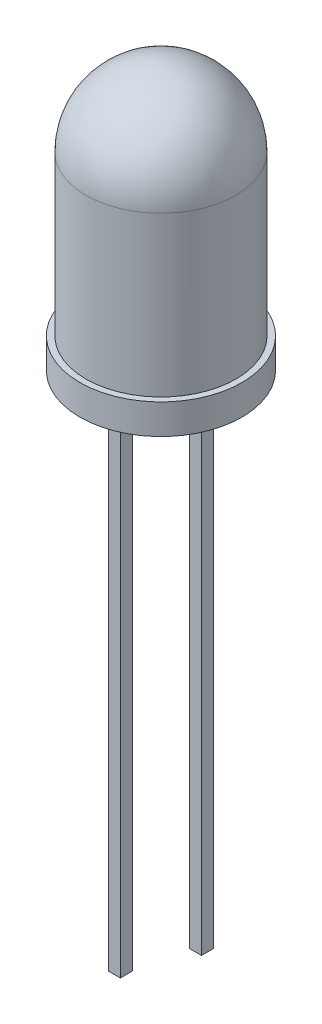
ISO-10303-21;
HEADER;
FILE_DESCRIPTION(('STEP AP214'),'2;1');
FILE_NAME('part.step','',(''),(''),'','','');
FILE_SCHEMA(('AUTOMOTIVE_DESIGN { 1 0 10303 214 1 1 1 1 }'));
ENDSEC;
DATA;
#1=APPLICATION_CONTEXT('core data for automotive mechanical design processes');
#2=APPLICATION_PROTOCOL_DEFINITION('international standard','automotive_design',2000,#1);
#3=PRODUCT_CONTEXT('',#1,'mechanical');
#4=PRODUCT('Part','Part','',(#3));
#5=PRODUCT_RELATED_PRODUCT_CATEGORY('part','',(#4));
#6=PRODUCT_DEFINITION_FORMATION('','',#4);
#7=PRODUCT_DEFINITION_CONTEXT('part definition',#1,'design');
#8=PRODUCT_DEFINITION('design','',#6,#7);
#9=PRODUCT_DEFINITION_SHAPE('','',#8);
#10=(LENGTH_UNIT() NAMED_UNIT(*) SI_UNIT(.MILLI.,.METRE.));
#11=(NAMED_UNIT(*) PLANE_ANGLE_UNIT() SI_UNIT($,.RADIAN.));
#12=(NAMED_UNIT(*) SI_UNIT($,.STERADIAN.) SOLID_ANGLE_UNIT());
#13=UNCERTAINTY_MEASURE_WITH_UNIT(LENGTH_MEASURE(1.E-05),#10,'distance_accuracy_value','');
#14=(GEOMETRIC_REPRESENTATION_CONTEXT(3) GLOBAL_UNCERTAINTY_ASSIGNED_CONTEXT((#13)) GLOBAL_UNIT_ASSIGNED_CONTEXT((#10,
#11,#12)) REPRESENTATION_CONTEXT('',''));
#15=CARTESIAN_POINT('',(0.,0.,0.));
#16=DIRECTION('',(0.,0.,1.));
#17=DIRECTION('',(1.,0.,0.));
#18=AXIS2_PLACEMENT_3D('',#15,#16,#17);
#19=CARTESIAN_POINT('',(0.,0.,0.));
#20=DIRECTION('',(0.,1.,0.));
#21=DIRECTION('',(0.,0.,1.));
#22=AXIS2_PLACEMENT_3D('',#19,#20,#21);
#23=PLANE('',#22);
#24=DIRECTION('',(-1.,0.,0.));
#25=VECTOR('',#24,1.);
#26=CARTESIAN_POINT('',(1.15,0.,-0.2));
#27=LINE('',#26,#25);
#28=CARTESIAN_POINT('',(1.55,0.,-0.2));
#29=VERTEX_POINT('',#28);
#30=CARTESIAN_POINT('',(1.15,0.,-0.2));
#31=VERTEX_POINT('',#30);
#32=EDGE_CURVE('E154',#29,#31,#27,.T.);
#33=ORIENTED_EDGE('',*,*,#32,.T.);
#34=DIRECTION('',(0.,0.,1.));
#35=VECTOR('',#34,1.);
#36=CARTESIAN_POINT('',(1.15,0.,-0.2));
#37=LINE('',#36,#35);
#38=CARTESIAN_POINT('',(1.15,0.,0.2));
#39=VERTEX_POINT('',#38);
#40=EDGE_CURVE('E158',#31,#39,#37,.T.);
#41=ORIENTED_EDGE('',*,*,#40,.T.);
#42=DIRECTION('',(-1.,0.,0.));
#43=VECTOR('',#42,1.);
#44=CARTESIAN_POINT('',(1.15,0.,0.2));
#45=LINE('',#44,#43);
#46=CARTESIAN_POINT('',(1.55,0.,0.2));
#47=VERTEX_POINT('',#46);
#48=EDGE_CURVE('E144',#47,#39,#45,.T.);
#49=ORIENTED_EDGE('',*,*,#48,.F.);
#50=DIRECTION('',(0.,0.,1.));
#51=VECTOR('',#50,1.);
#52=CARTESIAN_POINT('',(1.55,0.,-0.2));
#53=LINE('',#52,#51);
#54=EDGE_CURVE('E162',#29,#47,#53,.T.);
#55=ORIENTED_EDGE('',*,*,#54,.F.);
#56=EDGE_LOOP('',(#33,#41,#49,#55));
#57=FACE_BOUND('',#56,.T.);
#58=CARTESIAN_POINT('',(0.,0.,0.));
#59=DIRECTION('',(0.,1.,0.));
#60=DIRECTION('',(0.,0.,1.));
#61=AXIS2_PLACEMENT_3D('',#58,#59,#60);
#62=CIRCLE('',#61,2.7);
#63=CARTESIAN_POINT('',(0.,0.,2.7));
#64=VERTEX_POINT('',#63);
#65=EDGE_CURVE('E11',#64,#64,#62,.T.);
#66=ORIENTED_EDGE('',*,*,#65,.F.);
#67=EDGE_LOOP('',(#66));
#68=FACE_BOUND('',#67,.T.);
#69=DIRECTION('',(-1.,0.,0.));
#70=VECTOR('',#69,1.);
#71=CARTESIAN_POINT('',(-1.55,0.,-0.2));
#72=LINE('',#71,#70);
#73=CARTESIAN_POINT('',(-1.15,0.,-0.2));
#74=VERTEX_POINT('',#73);
#75=CARTESIAN_POINT('',(-1.55,0.,-0.2));
#76=VERTEX_POINT('',#75);
#77=EDGE_CURVE('E114',#74,#76,#72,.T.);
#78=ORIENTED_EDGE('',*,*,#77,.T.);
#79=DIRECTION('',(0.,0.,1.));
#80=VECTOR('',#79,1.);
#81=CARTESIAN_POINT('',(-1.55,0.,-0.2));
#82=LINE('',#81,#80);
#83=CARTESIAN_POINT('',(-1.55,0.,0.2));
#84=VERTEX_POINT('',#83);
#85=EDGE_CURVE('E133',#76,#84,#82,.T.);
#86=ORIENTED_EDGE('',*,*,#85,.T.);
#87=DIRECTION('',(-1.,0.,0.));
#88=VECTOR('',#87,1.);
#89=CARTESIAN_POINT('',(-1.55,0.,0.2));
#90=LINE('',#89,#88);
#91=CARTESIAN_POINT('',(-1.15,0.,0.2));
#92=VERTEX_POINT('',#91);
#93=EDGE_CURVE('E121',#92,#84,#90,.T.);
#94=ORIENTED_EDGE('',*,*,#93,.F.);
#95=DIRECTION('',(0.,0.,1.));
#96=VECTOR('',#95,1.);
#97=CARTESIAN_POINT('',(-1.15,0.,-0.2));
#98=LINE('',#97,#96);
#99=EDGE_CURVE('E136',#74,#92,#98,.T.);
#100=ORIENTED_EDGE('',*,*,#99,.F.);
#101=EDGE_LOOP('',(#78,#86,#94,#100));
#102=FACE_BOUND('',#101,.T.);
#103=ADVANCED_FACE('F36',(#57,#68,#102),#23,.F.);
#104=CARTESIAN_POINT('',(0.,8.8,0.));
#105=DIRECTION('',(0.,1.,0.));
#106=DIRECTION('',(0.,0.,1.));
#107=AXIS2_PLACEMENT_3D('',#104,#105,#106);
#108=CYLINDRICAL_SURFACE('',#107,2.7);
#109=CARTESIAN_POINT('',(0.,1.,0.));
#110=DIRECTION('',(0.,1.,0.));
#111=DIRECTION('',(0.,0.,1.));
#112=AXIS2_PLACEMENT_3D('',#109,#110,#111);
#113=CIRCLE('',#112,2.7);
#114=CARTESIAN_POINT('',(0.,1.,2.7));
#115=VERTEX_POINT('',#114);
#116=EDGE_CURVE('E43',#115,#115,#113,.T.);
#117=ORIENTED_EDGE('',*,*,#116,.F.);
#118=EDGE_LOOP('',(#117));
#119=FACE_BOUND('',#118,.T.);
#120=ORIENTED_EDGE('',*,*,#65,.T.);
#121=EDGE_LOOP('',(#120));
#122=FACE_BOUND('',#121,.T.);
#123=ADVANCED_FACE('F176',(#119,#122),#108,.T.);
#124=CARTESIAN_POINT('',(2.7,1.,0.));
#125=DIRECTION('',(0.,-1.,0.));
#126=DIRECTION('',(0.,0.,-1.));
#127=AXIS2_PLACEMENT_3D('',#124,#125,#126);
#128=PLANE('',#127);
#129=CARTESIAN_POINT('',(0.,1.,0.));
#130=DIRECTION('',(0.,1.,0.));
#131=DIRECTION('',(0.,0.,1.));
#132=AXIS2_PLACEMENT_3D('',#129,#130,#131);
#133=CIRCLE('',#132,2.5);
#134=CARTESIAN_POINT('',(0.,1.,2.5));
#135=VERTEX_POINT('',#134);
#136=EDGE_CURVE('E169',#135,#135,#133,.T.);
#137=ORIENTED_EDGE('',*,*,#136,.F.);
#138=EDGE_LOOP('',(#137));
#139=FACE_BOUND('',#138,.T.);
#140=ORIENTED_EDGE('',*,*,#116,.T.);
#141=EDGE_LOOP('',(#140));
#142=FACE_BOUND('',#141,.T.);
#143=ADVANCED_FACE('F174',(#139,#142),#128,.F.);
#144=CARTESIAN_POINT('',(0.,8.8,0.));
#145=DIRECTION('',(0.,1.,0.));
#146=DIRECTION('',(0.,0.,1.));
#147=AXIS2_PLACEMENT_3D('',#144,#145,#146);
#148=CYLINDRICAL_SURFACE('',#147,2.5);
#149=CARTESIAN_POINT('',(0.,6.3,0.));
#150=DIRECTION('',(0.,1.,0.));
#151=DIRECTION('',(0.,0.,1.));
#152=AXIS2_PLACEMENT_3D('',#149,#150,#151);
#153=CIRCLE('',#152,2.5);
#154=CARTESIAN_POINT('',(0.,6.3,2.5));
#155=VERTEX_POINT('',#154);
#156=EDGE_CURVE('E161',#155,#155,#153,.T.);
#157=ORIENTED_EDGE('',*,*,#156,.F.);
#158=EDGE_LOOP('',(#157));
#159=FACE_BOUND('',#158,.T.);
#160=ORIENTED_EDGE('',*,*,#136,.T.);
#161=EDGE_LOOP('',(#160));
#162=FACE_BOUND('',#161,.T.);
#163=ADVANCED_FACE('F224',(#159,#162),#148,.T.);
#164=CARTESIAN_POINT('',(0.,6.3,0.));
#165=DIRECTION('',(0.,1.,0.));
#166=DIRECTION('',(1.,0.,0.));
#167=AXIS2_PLACEMENT_3D('',#164,#165,#166);
#168=SPHERICAL_SURFACE('',#167,2.5);
#169=ORIENTED_EDGE('',*,*,#156,.T.);
#170=EDGE_LOOP('',(#169));
#171=FACE_BOUND('',#170,.T.);
#172=ADVANCED_FACE('F220',(#171),#168,.T.);
#173=CARTESIAN_POINT('',(1.15,0.,-0.2));
#174=DIRECTION('',(-1.,0.,0.));
#175=DIRECTION('',(0.,-1.,0.));
#176=AXIS2_PLACEMENT_3D('',#173,#174,#175);
#177=PLANE('',#176);
#178=DIRECTION('',(0.,0.,1.));
#179=VECTOR('',#178,1.);
#180=CARTESIAN_POINT('',(1.15,-16.,-0.2));
#181=LINE('',#180,#179);
#182=CARTESIAN_POINT('',(1.15,-16.,-0.2));
#183=VERTEX_POINT('',#182);
#184=CARTESIAN_POINT('',(1.15,-16.,0.2));
#185=VERTEX_POINT('',#184);
#186=EDGE_CURVE('E157',#183,#185,#181,.T.);
#187=ORIENTED_EDGE('',*,*,#186,.T.);
#188=DIRECTION('',(0.,-1.,0.));
#189=VECTOR('',#188,1.);
#190=CARTESIAN_POINT('',(1.15,0.,0.2));
#191=LINE('',#190,#189);
#192=EDGE_CURVE('E135',#39,#185,#191,.T.);
#193=ORIENTED_EDGE('',*,*,#192,.F.);
#194=ORIENTED_EDGE('',*,*,#40,.F.);
#195=DIRECTION('',(0.,-1.,0.));
#196=VECTOR('',#195,1.);
#197=CARTESIAN_POINT('',(1.15,0.,-0.2));
#198=LINE('',#197,#196);
#199=EDGE_CURVE('E146',#31,#183,#198,.T.);
#200=ORIENTED_EDGE('',*,*,#199,.T.);
#201=EDGE_LOOP('',(#187,#193,#194,#200));
#202=FACE_BOUND('',#201,.T.);
#203=ADVANCED_FACE('F213',(#202),#177,.T.);
#204=CARTESIAN_POINT('',(1.55,0.,-0.2));
#205=DIRECTION('',(1.,0.,0.));
#206=DIRECTION('',(0.,1.,0.));
#207=AXIS2_PLACEMENT_3D('',#204,#205,#206);
#208=PLANE('',#207);
#209=ORIENTED_EDGE('',*,*,#54,.T.);
#210=DIRECTION('',(0.,1.,0.));
#211=VECTOR('',#210,1.);
#212=CARTESIAN_POINT('',(1.55,0.,0.2));
#213=LINE('',#212,#211);
#214=CARTESIAN_POINT('',(1.55,-16.,0.2));
#215=VERTEX_POINT('',#214);
#216=EDGE_CURVE('E58',#215,#47,#213,.T.);
#217=ORIENTED_EDGE('',*,*,#216,.F.);
#218=DIRECTION('',(0.,0.,1.));
#219=VECTOR('',#218,1.);
#220=CARTESIAN_POINT('',(1.55,-16.,-0.2));
#221=LINE('',#220,#219);
#222=CARTESIAN_POINT('',(1.55,-16.,-0.2));
#223=VERTEX_POINT('',#222);
#224=EDGE_CURVE('E164',#223,#215,#221,.T.);
#225=ORIENTED_EDGE('',*,*,#224,.F.);
#226=DIRECTION('',(0.,1.,0.));
#227=VECTOR('',#226,1.);
#228=CARTESIAN_POINT('',(1.55,0.,-0.2));
#229=LINE('',#228,#227);
#230=EDGE_CURVE('E152',#223,#29,#229,.T.);
#231=ORIENTED_EDGE('',*,*,#230,.T.);
#232=EDGE_LOOP('',(#209,#217,#225,#231));
#233=FACE_BOUND('',#232,.T.);
#234=ADVANCED_FACE('F210',(#233),#208,.T.);
#235=CARTESIAN_POINT('',(1.15,-16.,-0.2));
#236=DIRECTION('',(0.,-1.,0.));
#237=DIRECTION('',(0.,0.,-1.));
#238=AXIS2_PLACEMENT_3D('',#235,#236,#237);
#239=PLANE('',#238);
#240=ORIENTED_EDGE('',*,*,#224,.T.);
#241=DIRECTION('',(1.,0.,0.));
#242=VECTOR('',#241,1.);
#243=CARTESIAN_POINT('',(1.15,-16.,0.2));
#244=LINE('',#243,#242);
#245=EDGE_CURVE('E141',#185,#215,#244,.T.);
#246=ORIENTED_EDGE('',*,*,#245,.F.);
#247=ORIENTED_EDGE('',*,*,#186,.F.);
#248=DIRECTION('',(1.,0.,0.));
#249=VECTOR('',#248,1.);
#250=CARTESIAN_POINT('',(1.15,-16.,-0.2));
#251=LINE('',#250,#249);
#252=EDGE_CURVE('E149',#183,#223,#251,.T.);
#253=ORIENTED_EDGE('',*,*,#252,.T.);
#254=EDGE_LOOP('',(#240,#246,#247,#253));
#255=FACE_BOUND('',#254,.T.);
#256=ADVANCED_FACE('F208',(#255),#239,.T.);
#257=CARTESIAN_POINT('',(0.,0.,-0.2));
#258=DIRECTION('',(0.,0.,1.));
#259=DIRECTION('',(1.,0.,0.));
#260=AXIS2_PLACEMENT_3D('',#257,#258,#259);
#261=PLANE('',#260);
#262=ORIENTED_EDGE('',*,*,#199,.F.);
#263=ORIENTED_EDGE('',*,*,#32,.F.);
#264=ORIENTED_EDGE('',*,*,#230,.F.);
#265=ORIENTED_EDGE('',*,*,#252,.F.);
#266=EDGE_LOOP('',(#262,#263,#264,#265));
#267=FACE_BOUND('',#266,.T.);
#268=ADVANCED_FACE('F205',(#267),#261,.F.);
#269=CARTESIAN_POINT('',(0.,0.,0.2));
#270=DIRECTION('',(0.,0.,1.));
#271=DIRECTION('',(1.,0.,0.));
#272=AXIS2_PLACEMENT_3D('',#269,#270,#271);
#273=PLANE('',#272);
#274=ORIENTED_EDGE('',*,*,#192,.T.);
#275=ORIENTED_EDGE('',*,*,#245,.T.);
#276=ORIENTED_EDGE('',*,*,#216,.T.);
#277=ORIENTED_EDGE('',*,*,#48,.T.);
#278=EDGE_LOOP('',(#274,#275,#276,#277));
#279=FACE_BOUND('',#278,.T.);
#280=ADVANCED_FACE('F198',(#279),#273,.T.);
#281=CARTESIAN_POINT('',(-1.55,0.,-0.2));
#282=DIRECTION('',(-1.,0.,0.));
#283=DIRECTION('',(0.,-1.,0.));
#284=AXIS2_PLACEMENT_3D('',#281,#282,#283);
#285=PLANE('',#284);
#286=DIRECTION('',(0.,0.,1.));
#287=VECTOR('',#286,1.);
#288=CARTESIAN_POINT('',(-1.55,-18.,-0.2));
#289=LINE('',#288,#287);
#290=CARTESIAN_POINT('',(-1.55,-18.,-0.2));
#291=VERTEX_POINT('',#290);
#292=CARTESIAN_POINT('',(-1.55,-18.,0.2));
#293=VERTEX_POINT('',#292);
#294=EDGE_CURVE('E102',#291,#293,#289,.T.);
#295=ORIENTED_EDGE('',*,*,#294,.T.);
#296=DIRECTION('',(0.,-1.,0.));
#297=VECTOR('',#296,1.);
#298=CARTESIAN_POINT('',(-1.55,0.,0.2));
#299=LINE('',#298,#297);
#300=EDGE_CURVE('E106',#84,#293,#299,.T.);
#301=ORIENTED_EDGE('',*,*,#300,.F.);
#302=ORIENTED_EDGE('',*,*,#85,.F.);
#303=DIRECTION('',(0.,-1.,0.));
#304=VECTOR('',#303,1.);
#305=CARTESIAN_POINT('',(-1.55,0.,-0.2));
#306=LINE('',#305,#304);
#307=EDGE_CURVE('E109',#76,#291,#306,.T.);
#308=ORIENTED_EDGE('',*,*,#307,.T.);
#309=EDGE_LOOP('',(#295,#301,#302,#308));
#310=FACE_BOUND('',#309,.T.);
#311=ADVANCED_FACE('F104',(#310),#285,.T.);
#312=CARTESIAN_POINT('',(-1.15,0.,-0.2));
#313=DIRECTION('',(1.,0.,0.));
#314=DIRECTION('',(0.,1.,0.));
#315=AXIS2_PLACEMENT_3D('',#312,#313,#314);
#316=PLANE('',#315);
#317=ORIENTED_EDGE('',*,*,#99,.T.);
#318=DIRECTION('',(0.,1.,0.));
#319=VECTOR('',#318,1.);
#320=CARTESIAN_POINT('',(-1.15,0.,0.2));
#321=LINE('',#320,#319);
#322=CARTESIAN_POINT('',(-1.15,-18.,0.2));
#323=VERTEX_POINT('',#322);
#324=EDGE_CURVE('E50',#323,#92,#321,.T.);
#325=ORIENTED_EDGE('',*,*,#324,.F.);
#326=DIRECTION('',(0.,0.,1.));
#327=VECTOR('',#326,1.);
#328=CARTESIAN_POINT('',(-1.15,-18.,-0.2));
#329=LINE('',#328,#327);
#330=CARTESIAN_POINT('',(-1.15,-18.,-0.2));
#331=VERTEX_POINT('',#330);
#332=EDGE_CURVE('E113',#331,#323,#329,.T.);
#333=ORIENTED_EDGE('',*,*,#332,.F.);
#334=DIRECTION('',(0.,1.,0.));
#335=VECTOR('',#334,1.);
#336=CARTESIAN_POINT('',(-1.15,0.,-0.2));
#337=LINE('',#336,#335);
#338=EDGE_CURVE('E129',#331,#74,#337,.T.);
#339=ORIENTED_EDGE('',*,*,#338,.T.);
#340=EDGE_LOOP('',(#317,#325,#333,#339));
#341=FACE_BOUND('',#340,.T.);
#342=ADVANCED_FACE('F190',(#341),#316,.T.);
#343=CARTESIAN_POINT('',(-1.55,-18.,-0.2));
#344=DIRECTION('',(0.,-1.,0.));
#345=DIRECTION('',(0.,0.,-1.));
#346=AXIS2_PLACEMENT_3D('',#343,#344,#345);
#347=PLANE('',#346);
#348=ORIENTED_EDGE('',*,*,#332,.T.);
#349=DIRECTION('',(1.,0.,0.));
#350=VECTOR('',#349,1.);
#351=CARTESIAN_POINT('',(-1.55,-18.,0.2));
#352=LINE('',#351,#350);
#353=EDGE_CURVE('E116',#293,#323,#352,.T.);
#354=ORIENTED_EDGE('',*,*,#353,.F.);
#355=ORIENTED_EDGE('',*,*,#294,.F.);
#356=DIRECTION('',(1.,0.,0.));
#357=VECTOR('',#356,1.);
#358=CARTESIAN_POINT('',(-1.55,-18.,-0.2));
#359=LINE('',#358,#357);
#360=EDGE_CURVE('E127',#291,#331,#359,.T.);
#361=ORIENTED_EDGE('',*,*,#360,.T.);
#362=EDGE_LOOP('',(#348,#354,#355,#361));
#363=FACE_BOUND('',#362,.T.);
#364=ADVANCED_FACE('F117',(#363),#347,.T.);
#365=CARTESIAN_POINT('',(0.,0.,-0.2));
#366=DIRECTION('',(0.,0.,1.));
#367=DIRECTION('',(1.,0.,0.));
#368=AXIS2_PLACEMENT_3D('',#365,#366,#367);
#369=PLANE('',#368);
#370=ORIENTED_EDGE('',*,*,#307,.F.);
#371=ORIENTED_EDGE('',*,*,#77,.F.);
#372=ORIENTED_EDGE('',*,*,#338,.F.);
#373=ORIENTED_EDGE('',*,*,#360,.F.);
#374=EDGE_LOOP('',(#370,#371,#372,#373));
#375=FACE_BOUND('',#374,.T.);
#376=ADVANCED_FACE('F188',(#375),#369,.F.);
#377=CARTESIAN_POINT('',(0.,0.,0.2));
#378=DIRECTION('',(0.,0.,1.));
#379=DIRECTION('',(1.,0.,0.));
#380=AXIS2_PLACEMENT_3D('',#377,#378,#379);
#381=PLANE('',#380);
#382=ORIENTED_EDGE('',*,*,#300,.T.);
#383=ORIENTED_EDGE('',*,*,#353,.T.);
#384=ORIENTED_EDGE('',*,*,#324,.T.);
#385=ORIENTED_EDGE('',*,*,#93,.T.);
#386=EDGE_LOOP('',(#382,#383,#384,#385));
#387=FACE_BOUND('',#386,.T.);
#388=ADVANCED_FACE('F119',(#387),#381,.T.);
#389=CLOSED_SHELL('',(#103,#123,#143,#163,#172,#203,#234,#256,#268,#280,#311,#342,#364,#376,#388));
#390=MANIFOLD_SOLID_BREP('B2',#389);
#391=ADVANCED_BREP_SHAPE_REPRESENTATION('',(#18,#390),#14);
#392=SHAPE_DEFINITION_REPRESENTATION(#9,#391);
ENDSEC;
END-ISO-10303-21;
